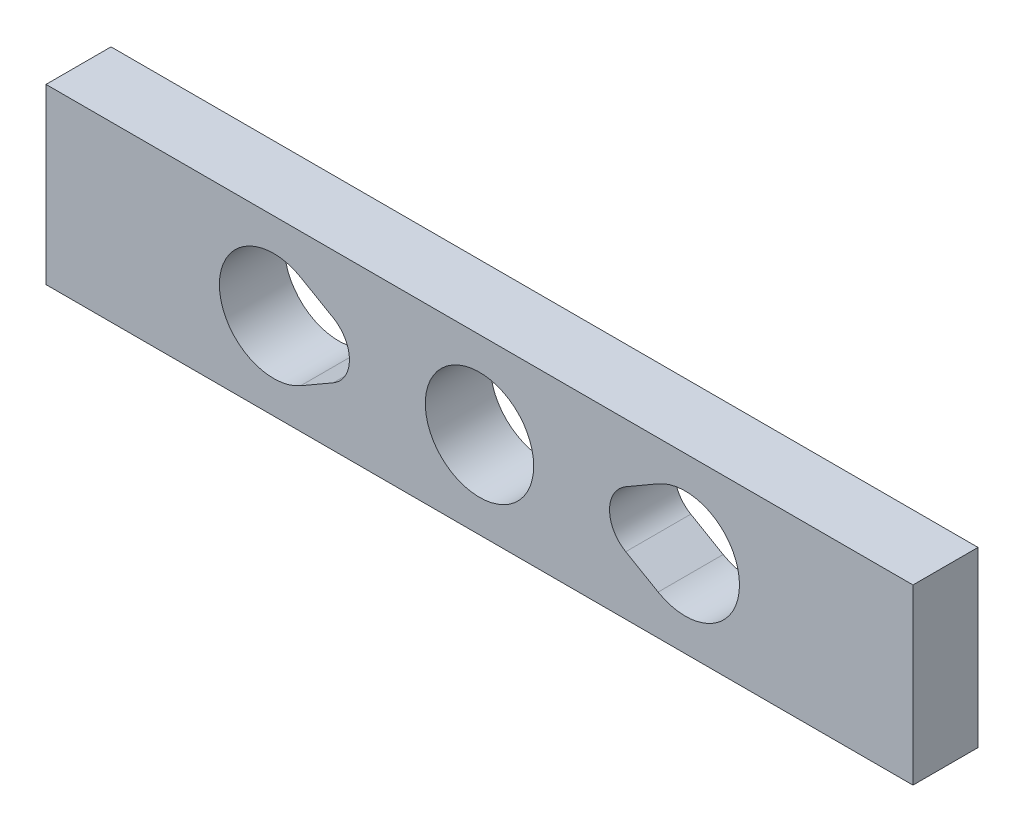
ISO-10303-21;
HEADER;
FILE_DESCRIPTION(('STEP AP214'),'2;1');
FILE_NAME('part.step','',(''),(''),'','','');
FILE_SCHEMA(('AUTOMOTIVE_DESIGN { 1 0 10303 214 1 1 1 1 }'));
ENDSEC;
DATA;
#1=APPLICATION_CONTEXT('core data for automotive mechanical design processes');
#2=APPLICATION_PROTOCOL_DEFINITION('international standard','automotive_design',2000,#1);
#3=PRODUCT_CONTEXT('',#1,'mechanical');
#4=PRODUCT('Part','Part','',(#3));
#5=PRODUCT_RELATED_PRODUCT_CATEGORY('part','',(#4));
#6=PRODUCT_DEFINITION_FORMATION('','',#4);
#7=PRODUCT_DEFINITION_CONTEXT('part definition',#1,'design');
#8=PRODUCT_DEFINITION('design','',#6,#7);
#9=PRODUCT_DEFINITION_SHAPE('','',#8);
#10=(LENGTH_UNIT() NAMED_UNIT(*) SI_UNIT(.MILLI.,.METRE.));
#11=(NAMED_UNIT(*) PLANE_ANGLE_UNIT() SI_UNIT($,.RADIAN.));
#12=(NAMED_UNIT(*) SI_UNIT($,.STERADIAN.) SOLID_ANGLE_UNIT());
#13=UNCERTAINTY_MEASURE_WITH_UNIT(LENGTH_MEASURE(1.E-05),#10,'distance_accuracy_value','');
#14=(GEOMETRIC_REPRESENTATION_CONTEXT(3) GLOBAL_UNCERTAINTY_ASSIGNED_CONTEXT((#13)) GLOBAL_UNIT_ASSIGNED_CONTEXT((#10,
#11,#12)) REPRESENTATION_CONTEXT('',''));
#15=CARTESIAN_POINT('',(0.,0.,0.));
#16=DIRECTION('',(0.,0.,1.));
#17=DIRECTION('',(1.,0.,0.));
#18=AXIS2_PLACEMENT_3D('',#15,#16,#17);
#19=CARTESIAN_POINT('',(0.,5.00081941511751,3.));
#20=DIRECTION('',(0.,-1.,0.));
#21=DIRECTION('',(1.,0.,0.));
#22=AXIS2_PLACEMENT_3D('',#19,#20,#21);
#23=PLANE('',#22);
#24=DIRECTION('',(-1.,0.,0.));
#25=VECTOR('',#24,1.);
#26=CARTESIAN_POINT('',(0.,5.00081941511751,0.));
#27=LINE('',#26,#25);
#28=CARTESIAN_POINT('',(20.0036791892623,5.00081941511752,0.));
#29=VERTEX_POINT('',#28);
#30=CARTESIAN_POINT('',(-19.9963208107377,5.0008194151175,0.));
#31=VERTEX_POINT('',#30);
#32=EDGE_CURVE('E184',#29,#31,#27,.T.);
#33=ORIENTED_EDGE('',*,*,#32,.T.);
#34=DIRECTION('',(0.,0.,-1.));
#35=VECTOR('',#34,1.);
#36=CARTESIAN_POINT('',(-19.9963208107377,5.0008194151175,3.));
#37=LINE('',#36,#35);
#38=CARTESIAN_POINT('',(-19.9963208107377,5.0008194151175,3.));
#39=VERTEX_POINT('',#38);
#40=EDGE_CURVE('E11',#39,#31,#37,.T.);
#41=ORIENTED_EDGE('',*,*,#40,.F.);
#42=DIRECTION('',(-1.,0.,0.));
#43=VECTOR('',#42,1.);
#44=CARTESIAN_POINT('',(0.,5.00081941511751,3.));
#45=LINE('',#44,#43);
#46=CARTESIAN_POINT('',(20.0036791892623,5.00081941511752,3.));
#47=VERTEX_POINT('',#46);
#48=EDGE_CURVE('E140',#47,#39,#45,.T.);
#49=ORIENTED_EDGE('',*,*,#48,.F.);
#50=DIRECTION('',(0.,0.,-1.));
#51=VECTOR('',#50,1.);
#52=CARTESIAN_POINT('',(20.0036791892623,5.00081941511752,3.));
#53=LINE('',#52,#51);
#54=EDGE_CURVE('E54',#47,#29,#53,.T.);
#55=ORIENTED_EDGE('',*,*,#54,.T.);
#56=EDGE_LOOP('',(#33,#41,#49,#55));
#57=FACE_BOUND('',#56,.T.);
#58=ADVANCED_FACE('F35',(#57),#23,.F.);
#59=CARTESIAN_POINT('',(-19.9963208107377,0.,3.));
#60=DIRECTION('',(1.,0.,0.));
#61=DIRECTION('',(0.,1.,0.));
#62=AXIS2_PLACEMENT_3D('',#59,#60,#61);
#63=PLANE('',#62);
#64=DIRECTION('',(0.,-1.,0.));
#65=VECTOR('',#64,1.);
#66=CARTESIAN_POINT('',(-19.9963208107377,0.,0.));
#67=LINE('',#66,#65);
#68=CARTESIAN_POINT('',(-19.9963208107377,-2.9991805848825,0.));
#69=VERTEX_POINT('',#68);
#70=EDGE_CURVE('E146',#31,#69,#67,.T.);
#71=ORIENTED_EDGE('',*,*,#70,.T.);
#72=DIRECTION('',(0.,0.,-1.));
#73=VECTOR('',#72,1.);
#74=CARTESIAN_POINT('',(-19.9963208107377,-2.9991805848825,3.));
#75=LINE('',#74,#73);
#76=CARTESIAN_POINT('',(-19.9963208107377,-2.9991805848825,3.));
#77=VERTEX_POINT('',#76);
#78=EDGE_CURVE('E45',#77,#69,#75,.T.);
#79=ORIENTED_EDGE('',*,*,#78,.F.);
#80=DIRECTION('',(0.,-1.,0.));
#81=VECTOR('',#80,1.);
#82=CARTESIAN_POINT('',(-19.9963208107377,0.,3.));
#83=LINE('',#82,#81);
#84=EDGE_CURVE('E134',#39,#77,#83,.T.);
#85=ORIENTED_EDGE('',*,*,#84,.F.);
#86=ORIENTED_EDGE('',*,*,#40,.T.);
#87=EDGE_LOOP('',(#71,#79,#85,#86));
#88=FACE_BOUND('',#87,.T.);
#89=ADVANCED_FACE('F145',(#88),#63,.F.);
#90=CARTESIAN_POINT('',(0.,-2.9991805848825,3.));
#91=DIRECTION('',(0.,-1.,0.));
#92=DIRECTION('',(1.,0.,0.));
#93=AXIS2_PLACEMENT_3D('',#90,#91,#92);
#94=PLANE('',#93);
#95=DIRECTION('',(-1.,0.,0.));
#96=VECTOR('',#95,1.);
#97=CARTESIAN_POINT('',(0.,-2.9991805848825,0.));
#98=LINE('',#97,#96);
#99=CARTESIAN_POINT('',(20.0036791892623,-2.99918058488249,0.));
#100=VERTEX_POINT('',#99);
#101=EDGE_CURVE('E187',#100,#69,#98,.T.);
#102=ORIENTED_EDGE('',*,*,#101,.F.);
#103=DIRECTION('',(0.,0.,-1.));
#104=VECTOR('',#103,1.);
#105=CARTESIAN_POINT('',(20.0036791892623,-2.99918058488249,3.));
#106=LINE('',#105,#104);
#107=CARTESIAN_POINT('',(20.0036791892623,-2.99918058488249,3.));
#108=VERTEX_POINT('',#107);
#109=EDGE_CURVE('E92',#108,#100,#106,.T.);
#110=ORIENTED_EDGE('',*,*,#109,.F.);
#111=DIRECTION('',(-1.,0.,0.));
#112=VECTOR('',#111,1.);
#113=CARTESIAN_POINT('',(0.,-2.9991805848825,3.));
#114=LINE('',#113,#112);
#115=EDGE_CURVE('E139',#108,#77,#114,.T.);
#116=ORIENTED_EDGE('',*,*,#115,.T.);
#117=ORIENTED_EDGE('',*,*,#78,.T.);
#118=EDGE_LOOP('',(#102,#110,#116,#117));
#119=FACE_BOUND('',#118,.T.);
#120=ADVANCED_FACE('F150',(#119),#94,.T.);
#121=CARTESIAN_POINT('',(-9.49632081073774,1.0008194151175,3.));
#122=DIRECTION('',(0.,0.,-1.));
#123=DIRECTION('',(-1.,0.,0.));
#124=AXIS2_PLACEMENT_3D('',#121,#122,#123);
#125=CYLINDRICAL_SURFACE('',#124,2.49999999999999);
#126=CARTESIAN_POINT('',(-9.49632081073774,1.0008194151175,0.));
#127=DIRECTION('',(0.,0.,1.));
#128=DIRECTION('',(1.,0.,0.));
#129=AXIS2_PLACEMENT_3D('',#126,#127,#128);
#130=CIRCLE('',#129,2.49999999999999);
#131=CARTESIAN_POINT('',(-8.24632014308584,3.16588253910945,0.));
#132=VERTEX_POINT('',#131);
#133=CARTESIAN_POINT('',(-8.24632014308585,-1.16424370887446,0.));
#134=VERTEX_POINT('',#133);
#135=EDGE_CURVE('E172',#132,#134,#130,.T.);
#136=ORIENTED_EDGE('',*,*,#135,.F.);
#137=DIRECTION('',(0.,0.,-1.));
#138=VECTOR('',#137,1.);
#139=CARTESIAN_POINT('',(-8.24632014308584,3.16588253910945,3.));
#140=LINE('',#139,#138);
#141=CARTESIAN_POINT('',(-8.24632014308584,3.16588253910945,3.));
#142=VERTEX_POINT('',#141);
#143=EDGE_CURVE('E194',#142,#132,#140,.T.);
#144=ORIENTED_EDGE('',*,*,#143,.F.);
#145=CARTESIAN_POINT('',(-9.49632081073774,1.0008194151175,3.));
#146=DIRECTION('',(0.,0.,1.));
#147=DIRECTION('',(1.,0.,0.));
#148=AXIS2_PLACEMENT_3D('',#145,#146,#147);
#149=CIRCLE('',#148,2.49999999999999);
#150=CARTESIAN_POINT('',(-8.24632014308585,-1.16424370887446,3.));
#151=VERTEX_POINT('',#150);
#152=EDGE_CURVE('E230',#142,#151,#149,.T.);
#153=ORIENTED_EDGE('',*,*,#152,.T.);
#154=DIRECTION('',(0.,0.,-1.));
#155=VECTOR('',#154,1.);
#156=CARTESIAN_POINT('',(-8.24632014308585,-1.16424370887446,3.));
#157=LINE('',#156,#155);
#158=EDGE_CURVE('E196',#151,#134,#157,.T.);
#159=ORIENTED_EDGE('',*,*,#158,.T.);
#160=EDGE_LOOP('',(#136,#144,#153,#159));
#161=FACE_BOUND('',#160,.T.);
#162=ADVANCED_FACE('F253',(#161),#125,.F.);
#163=CARTESIAN_POINT('',(-0.690714397767761,-1.19635157845672,3.));
#164=DIRECTION('',(-0.500000267060758,-0.866025249596783,0.));
#165=DIRECTION('',(0.866025249596783,-0.500000267060758,0.));
#166=AXIS2_PLACEMENT_3D('',#163,#164,#165);
#167=PLANE('',#166);
#168=DIRECTION('',(-0.866025249596783,0.500000267060758,0.));
#169=VECTOR('',#168,1.);
#170=CARTESIAN_POINT('',(-0.690714397767761,-1.19635157845672,0.));
#171=LINE('',#170,#169);
#172=CARTESIAN_POINT('',(-6.74632147838908,2.29985728951267,0.));
#173=VERTEX_POINT('',#172);
#174=EDGE_CURVE('E175',#173,#132,#171,.T.);
#175=ORIENTED_EDGE('',*,*,#174,.F.);
#176=DIRECTION('',(0.,0.,-1.));
#177=VECTOR('',#176,1.);
#178=CARTESIAN_POINT('',(-6.74632147838908,2.29985728951267,3.));
#179=LINE('',#178,#177);
#180=CARTESIAN_POINT('',(-6.74632147838908,2.29985728951267,3.));
#181=VERTEX_POINT('',#180);
#182=EDGE_CURVE('E200',#181,#173,#179,.T.);
#183=ORIENTED_EDGE('',*,*,#182,.F.);
#184=DIRECTION('',(-0.866025249596783,0.500000267060758,0.));
#185=VECTOR('',#184,1.);
#186=CARTESIAN_POINT('',(-0.690714397767761,-1.19635157845672,3.));
#187=LINE('',#186,#185);
#188=EDGE_CURVE('E233',#181,#142,#187,.T.);
#189=ORIENTED_EDGE('',*,*,#188,.T.);
#190=ORIENTED_EDGE('',*,*,#143,.T.);
#191=EDGE_LOOP('',(#175,#183,#189,#190));
#192=FACE_BOUND('',#191,.T.);
#193=ADVANCED_FACE('F256',(#192),#167,.T.);
#194=CARTESIAN_POINT('',(-7.49632187898021,1.0008194151175,3.));
#195=DIRECTION('',(0.,0.,-1.));
#196=DIRECTION('',(-1.,0.,0.));
#197=AXIS2_PLACEMENT_3D('',#194,#195,#196);
#198=CYLINDRICAL_SURFACE('',#197,1.5);
#199=CARTESIAN_POINT('',(-7.49632187898021,1.0008194151175,0.));
#200=DIRECTION('',(0.,0.,1.));
#201=DIRECTION('',(1.,0.,0.));
#202=AXIS2_PLACEMENT_3D('',#199,#200,#201);
#203=CIRCLE('',#202,1.5);
#204=CARTESIAN_POINT('',(-6.74632147838907,-0.298218459277677,0.));
#205=VERTEX_POINT('',#204);
#206=EDGE_CURVE('E178',#205,#173,#203,.T.);
#207=ORIENTED_EDGE('',*,*,#206,.F.);
#208=DIRECTION('',(0.,0.,-1.));
#209=VECTOR('',#208,1.);
#210=CARTESIAN_POINT('',(-6.74632147838907,-0.298218459277677,3.));
#211=LINE('',#210,#209);
#212=CARTESIAN_POINT('',(-6.74632147838907,-0.298218459277677,3.));
#213=VERTEX_POINT('',#212);
#214=EDGE_CURVE('E198',#213,#205,#211,.T.);
#215=ORIENTED_EDGE('',*,*,#214,.F.);
#216=CARTESIAN_POINT('',(-7.49632187898021,1.0008194151175,3.));
#217=DIRECTION('',(0.,0.,1.));
#218=DIRECTION('',(1.,0.,0.));
#219=AXIS2_PLACEMENT_3D('',#216,#217,#218);
#220=CIRCLE('',#219,1.5);
#221=EDGE_CURVE('E239',#213,#181,#220,.T.);
#222=ORIENTED_EDGE('',*,*,#221,.T.);
#223=ORIENTED_EDGE('',*,*,#182,.T.);
#224=EDGE_LOOP('',(#207,#215,#222,#223));
#225=FACE_BOUND('',#224,.T.);
#226=ADVANCED_FACE('F259',(#225),#198,.F.);
#227=CARTESIAN_POINT('',(1.5667544499834,2.70551240224712,3.));
#228=DIRECTION('',(-0.501133328191213,-0.865370086943151,0.));
#229=DIRECTION('',(0.865370086943152,-0.501133328191213,0.));
#230=AXIS2_PLACEMENT_3D('',#227,#228,#229);
#231=PLANE('',#230);
#232=DIRECTION('',(-0.865370086943152,0.501133328191213,0.));
#233=VECTOR('',#232,1.);
#234=CARTESIAN_POINT('',(1.5667544499834,2.70551240224712,0.));
#235=LINE('',#234,#233);
#236=CARTESIAN_POINT('',(8.24632281897723,-1.16260642707235,0.));
#237=VERTEX_POINT('',#236);
#238=CARTESIAN_POINT('',(6.75197853114087,-0.297235948330398,0.));
#239=VERTEX_POINT('',#238);
#240=EDGE_CURVE('E160',#237,#239,#235,.T.);
#241=ORIENTED_EDGE('',*,*,#240,.T.);
#242=DIRECTION('',(0.,0.,-1.));
#243=VECTOR('',#242,1.);
#244=CARTESIAN_POINT('',(6.75197853114087,-0.297235948330398,3.));
#245=LINE('',#244,#243);
#246=CARTESIAN_POINT('',(6.75197853114087,-0.297235948330398,3.));
#247=VERTEX_POINT('',#246);
#248=EDGE_CURVE('E39',#247,#239,#245,.T.);
#249=ORIENTED_EDGE('',*,*,#248,.F.);
#250=DIRECTION('',(-0.865370086943152,0.501133328191213,0.));
#251=VECTOR('',#250,1.);
#252=CARTESIAN_POINT('',(1.5667544499834,2.70551240224712,3.));
#253=LINE('',#252,#251);
#254=CARTESIAN_POINT('',(8.24632281897723,-1.16260642707235,3.));
#255=VERTEX_POINT('',#254);
#256=EDGE_CURVE('E105',#255,#247,#253,.T.);
#257=ORIENTED_EDGE('',*,*,#256,.F.);
#258=DIRECTION('',(0.,0.,-1.));
#259=VECTOR('',#258,1.);
#260=CARTESIAN_POINT('',(8.24632281897723,-1.16260642707235,3.));
#261=LINE('',#260,#259);
#262=EDGE_CURVE('E153',#255,#237,#261,.T.);
#263=ORIENTED_EDGE('',*,*,#262,.T.);
#264=EDGE_LOOP('',(#241,#249,#257,#263));
#265=FACE_BOUND('',#264,.T.);
#266=ADVANCED_FACE('F216',(#265),#231,.F.);
#267=CARTESIAN_POINT('',(7.50367812101979,1.0008194151175,3.));
#268=DIRECTION('',(0.,0.,-1.));
#269=DIRECTION('',(-1.,0.,0.));
#270=AXIS2_PLACEMENT_3D('',#267,#268,#269);
#271=CYLINDRICAL_SURFACE('',#270,1.5);
#272=CARTESIAN_POINT('',(7.50367812101979,1.0008194151175,0.));
#273=DIRECTION('',(0.,0.,1.));
#274=DIRECTION('',(1.,0.,0.));
#275=AXIS2_PLACEMENT_3D('',#272,#273,#274);
#276=CIRCLE('',#275,1.5);
#277=CARTESIAN_POINT('',(6.75197853114087,2.29887477856541,0.));
#278=VERTEX_POINT('',#277);
#279=EDGE_CURVE('E163',#278,#239,#276,.T.);
#280=ORIENTED_EDGE('',*,*,#279,.F.);
#281=DIRECTION('',(0.,0.,-1.));
#282=VECTOR('',#281,1.);
#283=CARTESIAN_POINT('',(6.75197853114087,2.29887477856541,3.));
#284=LINE('',#283,#282);
#285=CARTESIAN_POINT('',(6.75197853114087,2.29887477856541,3.));
#286=VERTEX_POINT('',#285);
#287=EDGE_CURVE('E205',#286,#278,#284,.T.);
#288=ORIENTED_EDGE('',*,*,#287,.F.);
#289=CARTESIAN_POINT('',(7.50367812101979,1.0008194151175,3.));
#290=DIRECTION('',(0.,0.,1.));
#291=DIRECTION('',(1.,0.,0.));
#292=AXIS2_PLACEMENT_3D('',#289,#290,#291);
#293=CIRCLE('',#292,1.5);
#294=EDGE_CURVE('E213',#286,#247,#293,.T.);
#295=ORIENTED_EDGE('',*,*,#294,.T.);
#296=ORIENTED_EDGE('',*,*,#248,.T.);
#297=EDGE_LOOP('',(#280,#288,#295,#296));
#298=FACE_BOUND('',#297,.T.);
#299=ADVANCED_FACE('F212',(#298),#271,.F.);
#300=CARTESIAN_POINT('',(0.698710701044557,-1.20655270429963,3.));
#301=DIRECTION('',(0.501133059919278,-0.865370242298602,0.));
#302=DIRECTION('',(0.865370242298602,0.501133059919278,0.));
#303=AXIS2_PLACEMENT_3D('',#300,#301,#302);
#304=PLANE('',#303);
#305=DIRECTION('',(-0.865370242298602,-0.501133059919278,0.));
#306=VECTOR('',#305,1.);
#307=CARTESIAN_POINT('',(0.698710701044557,-1.20655270429963,0.));
#308=LINE('',#307,#306);
#309=CARTESIAN_POINT('',(8.2477368673645,3.16506350946109,0.));
#310=VERTEX_POINT('',#309);
#311=EDGE_CURVE('E166',#310,#278,#308,.T.);
#312=ORIENTED_EDGE('',*,*,#311,.F.);
#313=DIRECTION('',(0.,0.,-1.));
#314=VECTOR('',#313,1.);
#315=CARTESIAN_POINT('',(8.2477368673645,3.16506350946109,3.));
#316=LINE('',#315,#314);
#317=CARTESIAN_POINT('',(8.2477368673645,3.16506350946109,3.));
#318=VERTEX_POINT('',#317);
#319=EDGE_CURVE('E204',#318,#310,#316,.T.);
#320=ORIENTED_EDGE('',*,*,#319,.F.);
#321=DIRECTION('',(-0.865370242298602,-0.501133059919278,0.));
#322=VECTOR('',#321,1.);
#323=CARTESIAN_POINT('',(0.698710701044557,-1.20655270429963,3.));
#324=LINE('',#323,#322);
#325=EDGE_CURVE('E223',#318,#286,#324,.T.);
#326=ORIENTED_EDGE('',*,*,#325,.T.);
#327=ORIENTED_EDGE('',*,*,#287,.T.);
#328=EDGE_LOOP('',(#312,#320,#326,#327));
#329=FACE_BOUND('',#328,.T.);
#330=ADVANCED_FACE('F221',(#329),#304,.T.);
#331=CARTESIAN_POINT('',(-1.55744974448794,2.69758016657363,3.));
#332=DIRECTION('',(0.500000267060758,-0.866025249596784,0.));
#333=DIRECTION('',(0.866025249596784,0.500000267060758,0.));
#334=AXIS2_PLACEMENT_3D('',#331,#332,#333);
#335=PLANE('',#334);
#336=DIRECTION('',(-0.866025249596784,-0.500000267060758,0.));
#337=VECTOR('',#336,1.);
#338=CARTESIAN_POINT('',(-1.55744974448794,2.69758016657363,0.));
#339=LINE('',#338,#337);
#340=EDGE_CURVE('E181',#205,#134,#339,.T.);
#341=ORIENTED_EDGE('',*,*,#340,.T.);
#342=ORIENTED_EDGE('',*,*,#158,.F.);
#343=DIRECTION('',(-0.866025249596784,-0.500000267060758,0.));
#344=VECTOR('',#343,1.);
#345=CARTESIAN_POINT('',(-1.55744974448794,2.69758016657363,3.));
#346=LINE('',#345,#344);
#347=EDGE_CURVE('E242',#213,#151,#346,.T.);
#348=ORIENTED_EDGE('',*,*,#347,.F.);
#349=ORIENTED_EDGE('',*,*,#214,.T.);
#350=EDGE_LOOP('',(#341,#342,#348,#349));
#351=FACE_BOUND('',#350,.T.);
#352=ADVANCED_FACE('F249',(#351),#335,.F.);
#353=CARTESIAN_POINT('',(9.49915292399128,1.0008194151175,3.));
#354=DIRECTION('',(0.,0.,-1.));
#355=DIRECTION('',(-1.,0.,0.));
#356=AXIS2_PLACEMENT_3D('',#353,#354,#355);
#357=CYLINDRICAL_SURFACE('',#356,2.49999892933665);
#358=CARTESIAN_POINT('',(9.49915292399128,1.0008194151175,0.));
#359=DIRECTION('',(0.,0.,1.));
#360=DIRECTION('',(1.,0.,0.));
#361=AXIS2_PLACEMENT_3D('',#358,#359,#360);
#362=CIRCLE('',#361,2.49999892933665);
#363=EDGE_CURVE('E169',#237,#310,#362,.T.);
#364=ORIENTED_EDGE('',*,*,#363,.F.);
#365=ORIENTED_EDGE('',*,*,#262,.F.);
#366=CARTESIAN_POINT('',(9.49915292399128,1.0008194151175,3.));
#367=DIRECTION('',(0.,0.,1.));
#368=DIRECTION('',(1.,0.,0.));
#369=AXIS2_PLACEMENT_3D('',#366,#367,#368);
#370=CIRCLE('',#369,2.49999892933665);
#371=EDGE_CURVE('E227',#255,#318,#370,.T.);
#372=ORIENTED_EDGE('',*,*,#371,.T.);
#373=ORIENTED_EDGE('',*,*,#319,.T.);
#374=EDGE_LOOP('',(#364,#365,#372,#373));
#375=FACE_BOUND('',#374,.T.);
#376=ADVANCED_FACE('F229',(#375),#357,.F.);
#377=CARTESIAN_POINT('',(0.00367918926225987,1.0008194151175,3.));
#378=DIRECTION('',(0.,0.,-1.));
#379=DIRECTION('',(-1.,0.,0.));
#380=AXIS2_PLACEMENT_3D('',#377,#378,#379);
#381=CYLINDRICAL_SURFACE('',#380,2.5);
#382=CARTESIAN_POINT('',(0.00367918926225987,1.0008194151175,3.));
#383=DIRECTION('',(0.,0.,1.));
#384=DIRECTION('',(1.,0.,0.));
#385=AXIS2_PLACEMENT_3D('',#382,#383,#384);
#386=CIRCLE('',#385,2.5);
#387=CARTESIAN_POINT('',(2.50367918926226,1.0008194151175,3.));
#388=VERTEX_POINT('',#387);
#389=EDGE_CURVE('E192',#388,#388,#386,.T.);
#390=ORIENTED_EDGE('',*,*,#389,.T.);
#391=EDGE_LOOP('',(#390));
#392=FACE_BOUND('',#391,.T.);
#393=CARTESIAN_POINT('',(0.00367918926225987,1.0008194151175,0.));
#394=DIRECTION('',(0.,0.,1.));
#395=DIRECTION('',(1.,0.,0.));
#396=AXIS2_PLACEMENT_3D('',#393,#394,#395);
#397=CIRCLE('',#396,2.5);
#398=CARTESIAN_POINT('',(2.50367918926226,1.0008194151175,0.));
#399=VERTEX_POINT('',#398);
#400=EDGE_CURVE('E157',#399,#399,#397,.T.);
#401=ORIENTED_EDGE('',*,*,#400,.F.);
#402=EDGE_LOOP('',(#401));
#403=FACE_BOUND('',#402,.T.);
#404=ADVANCED_FACE('F37',(#392,#403),#381,.F.);
#405=CARTESIAN_POINT('',(20.0036791892623,0.,3.));
#406=DIRECTION('',(1.,0.,0.));
#407=DIRECTION('',(0.,1.,0.));
#408=AXIS2_PLACEMENT_3D('',#405,#406,#407);
#409=PLANE('',#408);
#410=DIRECTION('',(0.,-1.,0.));
#411=VECTOR('',#410,1.);
#412=CARTESIAN_POINT('',(20.0036791892623,0.,0.));
#413=LINE('',#412,#411);
#414=EDGE_CURVE('E189',#29,#100,#413,.T.);
#415=ORIENTED_EDGE('',*,*,#414,.F.);
#416=ORIENTED_EDGE('',*,*,#54,.F.);
#417=DIRECTION('',(0.,-1.,0.));
#418=VECTOR('',#417,1.);
#419=CARTESIAN_POINT('',(20.0036791892623,0.,3.));
#420=LINE('',#419,#418);
#421=EDGE_CURVE('E151',#47,#108,#420,.T.);
#422=ORIENTED_EDGE('',*,*,#421,.T.);
#423=ORIENTED_EDGE('',*,*,#109,.T.);
#424=EDGE_LOOP('',(#415,#416,#422,#423));
#425=FACE_BOUND('',#424,.T.);
#426=ADVANCED_FACE('F264',(#425),#409,.T.);
#427=CARTESIAN_POINT('',(0.,0.,3.));
#428=DIRECTION('',(0.,0.,1.));
#429=DIRECTION('',(1.,0.,0.));
#430=AXIS2_PLACEMENT_3D('',#427,#428,#429);
#431=PLANE('',#430);
#432=ORIENTED_EDGE('',*,*,#389,.F.);
#433=EDGE_LOOP('',(#432));
#434=FACE_BOUND('',#433,.T.);
#435=ORIENTED_EDGE('',*,*,#256,.T.);
#436=ORIENTED_EDGE('',*,*,#294,.F.);
#437=ORIENTED_EDGE('',*,*,#325,.F.);
#438=ORIENTED_EDGE('',*,*,#371,.F.);
#439=EDGE_LOOP('',(#435,#436,#437,#438));
#440=FACE_BOUND('',#439,.T.);
#441=ORIENTED_EDGE('',*,*,#152,.F.);
#442=ORIENTED_EDGE('',*,*,#188,.F.);
#443=ORIENTED_EDGE('',*,*,#221,.F.);
#444=ORIENTED_EDGE('',*,*,#347,.T.);
#445=EDGE_LOOP('',(#441,#442,#443,#444));
#446=FACE_BOUND('',#445,.T.);
#447=ORIENTED_EDGE('',*,*,#48,.T.);
#448=ORIENTED_EDGE('',*,*,#84,.T.);
#449=ORIENTED_EDGE('',*,*,#115,.F.);
#450=ORIENTED_EDGE('',*,*,#421,.F.);
#451=EDGE_LOOP('',(#447,#448,#449,#450));
#452=FACE_BOUND('',#451,.T.);
#453=ADVANCED_FACE('F136',(#434,#440,#446,#452),#431,.T.);
#454=CARTESIAN_POINT('',(0.,0.,0.));
#455=DIRECTION('',(0.,0.,1.));
#456=DIRECTION('',(1.,0.,0.));
#457=AXIS2_PLACEMENT_3D('',#454,#455,#456);
#458=PLANE('',#457);
#459=ORIENTED_EDGE('',*,*,#400,.T.);
#460=EDGE_LOOP('',(#459));
#461=FACE_BOUND('',#460,.T.);
#462=ORIENTED_EDGE('',*,*,#240,.F.);
#463=ORIENTED_EDGE('',*,*,#363,.T.);
#464=ORIENTED_EDGE('',*,*,#311,.T.);
#465=ORIENTED_EDGE('',*,*,#279,.T.);
#466=EDGE_LOOP('',(#462,#463,#464,#465));
#467=FACE_BOUND('',#466,.T.);
#468=ORIENTED_EDGE('',*,*,#135,.T.);
#469=ORIENTED_EDGE('',*,*,#340,.F.);
#470=ORIENTED_EDGE('',*,*,#206,.T.);
#471=ORIENTED_EDGE('',*,*,#174,.T.);
#472=EDGE_LOOP('',(#468,#469,#470,#471));
#473=FACE_BOUND('',#472,.T.);
#474=ORIENTED_EDGE('',*,*,#32,.F.);
#475=ORIENTED_EDGE('',*,*,#414,.T.);
#476=ORIENTED_EDGE('',*,*,#101,.T.);
#477=ORIENTED_EDGE('',*,*,#70,.F.);
#478=EDGE_LOOP('',(#474,#475,#476,#477));
#479=FACE_BOUND('',#478,.T.);
#480=ADVANCED_FACE('F219',(#461,#467,#473,#479),#458,.F.);
#481=CLOSED_SHELL('',(#58,#89,#120,#162,#193,#226,#266,#299,#330,#352,#376,#404,#426,#453,#480));
#482=MANIFOLD_SOLID_BREP('B2',#481);
#483=ADVANCED_BREP_SHAPE_REPRESENTATION('',(#18,#482),#14);
#484=SHAPE_DEFINITION_REPRESENTATION(#9,#483);
ENDSEC;
END-ISO-10303-21;
